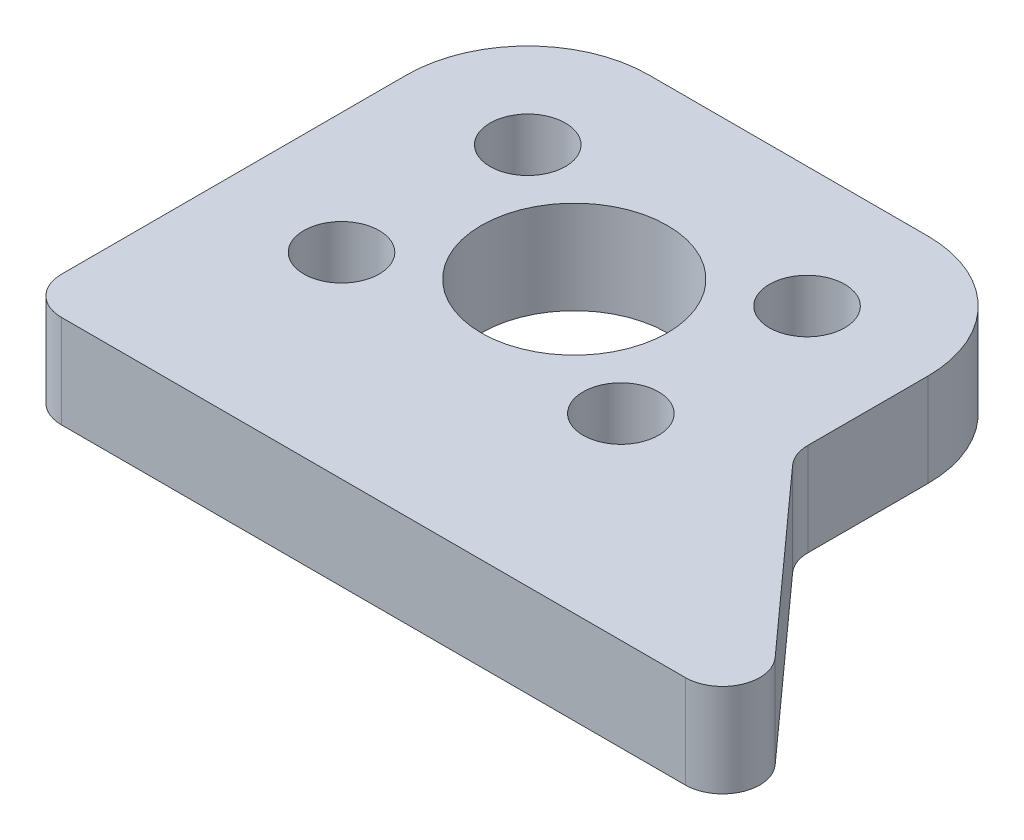
ISO-10303-21;
HEADER;
FILE_DESCRIPTION(('STEP AP214'),'2;1');
FILE_NAME('part.step','',(''),(''),'','','');
FILE_SCHEMA(('AUTOMOTIVE_DESIGN { 1 0 10303 214 1 1 1 1 }'));
ENDSEC;
DATA;
#1=APPLICATION_CONTEXT('core data for automotive mechanical design processes');
#2=APPLICATION_PROTOCOL_DEFINITION('international standard','automotive_design',2000,#1);
#3=PRODUCT_CONTEXT('',#1,'mechanical');
#4=PRODUCT('Part','Part','',(#3));
#5=PRODUCT_RELATED_PRODUCT_CATEGORY('part','',(#4));
#6=PRODUCT_DEFINITION_FORMATION('','',#4);
#7=PRODUCT_DEFINITION_CONTEXT('part definition',#1,'design');
#8=PRODUCT_DEFINITION('design','',#6,#7);
#9=PRODUCT_DEFINITION_SHAPE('','',#8);
#10=(LENGTH_UNIT() NAMED_UNIT(*) SI_UNIT(.MILLI.,.METRE.));
#11=(NAMED_UNIT(*) PLANE_ANGLE_UNIT() SI_UNIT($,.RADIAN.));
#12=(NAMED_UNIT(*) SI_UNIT($,.STERADIAN.) SOLID_ANGLE_UNIT());
#13=UNCERTAINTY_MEASURE_WITH_UNIT(LENGTH_MEASURE(1.E-05),#10,'distance_accuracy_value','');
#14=(GEOMETRIC_REPRESENTATION_CONTEXT(3) GLOBAL_UNCERTAINTY_ASSIGNED_CONTEXT((#13)) GLOBAL_UNIT_ASSIGNED_CONTEXT((#10,
#11,#12)) REPRESENTATION_CONTEXT('',''));
#15=CARTESIAN_POINT('',(0.,0.,0.));
#16=DIRECTION('',(0.,0.,1.));
#17=DIRECTION('',(1.,0.,0.));
#18=AXIS2_PLACEMENT_3D('',#15,#16,#17);
#19=CARTESIAN_POINT('',(-7.5,5.,5.));
#20=DIRECTION('',(0.,-1.,0.));
#21=DIRECTION('',(0.,0.,-1.));
#22=AXIS2_PLACEMENT_3D('',#19,#20,#21);
#23=CYLINDRICAL_SURFACE('',#22,2.025);
#24=CARTESIAN_POINT('',(-7.5,5.,5.));
#25=DIRECTION('',(0.,1.,0.));
#26=DIRECTION('',(0.,0.,1.));
#27=AXIS2_PLACEMENT_3D('',#24,#25,#26);
#28=CIRCLE('',#27,2.025);
#29=CARTESIAN_POINT('',(-7.5,5.,7.025));
#30=VERTEX_POINT('',#29);
#31=EDGE_CURVE('E264',#30,#30,#28,.T.);
#32=ORIENTED_EDGE('',*,*,#31,.T.);
#33=EDGE_LOOP('',(#32));
#34=FACE_BOUND('',#33,.T.);
#35=CARTESIAN_POINT('',(-7.5,0.,5.));
#36=DIRECTION('',(0.,1.,0.));
#37=DIRECTION('',(0.,0.,1.));
#38=AXIS2_PLACEMENT_3D('',#35,#36,#37);
#39=CIRCLE('',#38,2.025);
#40=CARTESIAN_POINT('',(-7.5,0.,7.025));
#41=VERTEX_POINT('',#40);
#42=EDGE_CURVE('E282',#41,#41,#39,.T.);
#43=ORIENTED_EDGE('',*,*,#42,.F.);
#44=EDGE_LOOP('',(#43));
#45=FACE_BOUND('',#44,.T.);
#46=ADVANCED_FACE('F91',(#34,#45),#23,.F.);
#47=CARTESIAN_POINT('',(7.5,5.,5.));
#48=DIRECTION('',(0.,-1.,0.));
#49=DIRECTION('',(0.,0.,-1.));
#50=AXIS2_PLACEMENT_3D('',#47,#48,#49);
#51=CYLINDRICAL_SURFACE('',#50,2.025);
#52=CARTESIAN_POINT('',(7.5,5.,5.));
#53=DIRECTION('',(0.,1.,0.));
#54=DIRECTION('',(0.,0.,1.));
#55=AXIS2_PLACEMENT_3D('',#52,#53,#54);
#56=CIRCLE('',#55,2.025);
#57=CARTESIAN_POINT('',(7.5,5.,7.025));
#58=VERTEX_POINT('',#57);
#59=EDGE_CURVE('E257',#58,#58,#56,.T.);
#60=ORIENTED_EDGE('',*,*,#59,.T.);
#61=EDGE_LOOP('',(#60));
#62=FACE_BOUND('',#61,.T.);
#63=CARTESIAN_POINT('',(7.5,0.,5.));
#64=DIRECTION('',(0.,1.,0.));
#65=DIRECTION('',(0.,0.,1.));
#66=AXIS2_PLACEMENT_3D('',#63,#64,#65);
#67=CIRCLE('',#66,2.025);
#68=CARTESIAN_POINT('',(7.5,0.,7.025));
#69=VERTEX_POINT('',#68);
#70=EDGE_CURVE('E279',#69,#69,#67,.T.);
#71=ORIENTED_EDGE('',*,*,#70,.F.);
#72=EDGE_LOOP('',(#71));
#73=FACE_BOUND('',#72,.T.);
#74=ADVANCED_FACE('F333',(#62,#73),#51,.F.);
#75=CARTESIAN_POINT('',(-14.,5.,0.));
#76=DIRECTION('',(1.,0.,0.));
#77=DIRECTION('',(0.,0.,-1.));
#78=AXIS2_PLACEMENT_3D('',#75,#76,#77);
#79=PLANE('',#78);
#80=DIRECTION('',(0.,0.,1.));
#81=VECTOR('',#80,1.);
#82=CARTESIAN_POINT('',(-14.,0.,0.));
#83=LINE('',#82,#81);
#84=CARTESIAN_POINT('',(-14.,0.,-5.));
#85=VERTEX_POINT('',#84);
#86=CARTESIAN_POINT('',(-14.,0.,13.5463315243403));
#87=VERTEX_POINT('',#86);
#88=EDGE_CURVE('E271',#85,#87,#83,.T.);
#89=ORIENTED_EDGE('',*,*,#88,.T.);
#90=DIRECTION('',(0.,-1.,0.));
#91=VECTOR('',#90,1.);
#92=CARTESIAN_POINT('',(-14.,5.,13.5463315243403));
#93=LINE('',#92,#91);
#94=CARTESIAN_POINT('',(-14.,5.,13.5463315243403));
#95=VERTEX_POINT('',#94);
#96=EDGE_CURVE('E106',#87,#95,#93,.F.);
#97=ORIENTED_EDGE('',*,*,#96,.T.);
#98=DIRECTION('',(0.,0.,1.));
#99=VECTOR('',#98,1.);
#100=CARTESIAN_POINT('',(-14.,5.,0.));
#101=LINE('',#100,#99);
#102=CARTESIAN_POINT('',(-14.,5.,-5.));
#103=VERTEX_POINT('',#102);
#104=EDGE_CURVE('E165',#103,#95,#101,.T.);
#105=ORIENTED_EDGE('',*,*,#104,.F.);
#106=DIRECTION('',(0.,-1.,0.));
#107=VECTOR('',#106,1.);
#108=CARTESIAN_POINT('',(-14.,5.,-5.));
#109=LINE('',#108,#107);
#110=EDGE_CURVE('E169',#103,#85,#109,.T.);
#111=ORIENTED_EDGE('',*,*,#110,.T.);
#112=EDGE_LOOP('',(#89,#97,#105,#111));
#113=FACE_BOUND('',#112,.T.);
#114=ADVANCED_FACE('F167',(#113),#79,.F.);
#115=CARTESIAN_POINT('',(0.,5.,15.5463315243403));
#116=DIRECTION('',(0.,0.,-1.));
#117=DIRECTION('',(-1.,0.,0.));
#118=AXIS2_PLACEMENT_3D('',#115,#116,#117);
#119=PLANE('',#118);
#120=DIRECTION('',(1.,0.,0.));
#121=VECTOR('',#120,1.);
#122=CARTESIAN_POINT('',(0.,5.,15.5463315243403));
#123=LINE('',#122,#121);
#124=CARTESIAN_POINT('',(-12.,5.,15.5463315243403));
#125=VERTEX_POINT('',#124);
#126=CARTESIAN_POINT('',(21.5079264521916,5.,15.5463315243403));
#127=VERTEX_POINT('',#126);
#128=EDGE_CURVE('E173',#125,#127,#123,.T.);
#129=ORIENTED_EDGE('',*,*,#128,.F.);
#130=DIRECTION('',(0.,-1.,0.));
#131=VECTOR('',#130,1.);
#132=CARTESIAN_POINT('',(-12.,5.,15.5463315243403));
#133=LINE('',#132,#131);
#134=CARTESIAN_POINT('',(-12.,0.,15.5463315243403));
#135=VERTEX_POINT('',#134);
#136=EDGE_CURVE('E218',#125,#135,#133,.T.);
#137=ORIENTED_EDGE('',*,*,#136,.T.);
#138=DIRECTION('',(1.,0.,0.));
#139=VECTOR('',#138,1.);
#140=CARTESIAN_POINT('',(0.,0.,15.5463315243403));
#141=LINE('',#140,#139);
#142=CARTESIAN_POINT('',(21.5079264521916,0.,15.5463315243403));
#143=VERTEX_POINT('',#142);
#144=EDGE_CURVE('E245',#135,#143,#141,.T.);
#145=ORIENTED_EDGE('',*,*,#144,.T.);
#146=DIRECTION('',(0.,-1.,0.));
#147=VECTOR('',#146,1.);
#148=CARTESIAN_POINT('',(21.5079264521916,5.,15.5463315243403));
#149=LINE('',#148,#147);
#150=EDGE_CURVE('E216',#143,#127,#149,.F.);
#151=ORIENTED_EDGE('',*,*,#150,.T.);
#152=EDGE_LOOP('',(#129,#137,#145,#151));
#153=FACE_BOUND('',#152,.T.);
#154=ADVANCED_FACE('F297',(#153),#119,.F.);
#155=CARTESIAN_POINT('',(6.62828647567442,5.,-5.96813594946186));
#156=DIRECTION('',(0.743144825477398,0.,-0.669130606358854));
#157=DIRECTION('',(-0.669130606358854,0.,-0.743144825477398));
#158=AXIS2_PLACEMENT_3D('',#155,#156,#157);
#159=PLANE('',#158);
#160=DIRECTION('',(0.669130606358854,0.,0.743144825477398));
#161=VECTOR('',#160,1.);
#162=CARTESIAN_POINT('',(6.62828647567442,0.,-5.96813594946186));
#163=LINE('',#162,#161);
#164=CARTESIAN_POINT('',(14.5137103490452,0.,2.78951448903672));
#165=VERTEX_POINT('',#164);
#166=CARTESIAN_POINT('',(22.9942161031464,0.,12.2080703116226));
#167=VERTEX_POINT('',#166);
#168=EDGE_CURVE('E233',#165,#167,#163,.T.);
#169=ORIENTED_EDGE('',*,*,#168,.F.);
#170=DIRECTION('',(0.,-1.,0.));
#171=VECTOR('',#170,1.);
#172=CARTESIAN_POINT('',(14.5137103490452,5.,2.78951448903672));
#173=LINE('',#172,#171);
#174=CARTESIAN_POINT('',(14.5137103490452,5.,2.78951448903672));
#175=VERTEX_POINT('',#174);
#176=EDGE_CURVE('E214',#165,#175,#173,.F.);
#177=ORIENTED_EDGE('',*,*,#176,.T.);
#178=DIRECTION('',(0.669130606358854,0.,0.743144825477398));
#179=VECTOR('',#178,1.);
#180=CARTESIAN_POINT('',(6.62828647567442,5.,-5.96813594946186));
#181=LINE('',#180,#179);
#182=CARTESIAN_POINT('',(22.9942161031464,5.,12.2080703116226));
#183=VERTEX_POINT('',#182);
#184=EDGE_CURVE('E252',#175,#183,#181,.T.);
#185=ORIENTED_EDGE('',*,*,#184,.T.);
#186=DIRECTION('',(0.,-1.,0.));
#187=VECTOR('',#186,1.);
#188=CARTESIAN_POINT('',(22.9942161031464,0.,12.2080703116226));
#189=LINE('',#188,#187);
#190=EDGE_CURVE('E193',#183,#167,#189,.T.);
#191=ORIENTED_EDGE('',*,*,#190,.T.);
#192=EDGE_LOOP('',(#169,#177,#185,#191));
#193=FACE_BOUND('',#192,.T.);
#194=ADVANCED_FACE('F241',(#193),#159,.T.);
#195=CARTESIAN_POINT('',(14.,5.,0.));
#196=DIRECTION('',(1.,0.,0.));
#197=DIRECTION('',(0.,0.,-1.));
#198=AXIS2_PLACEMENT_3D('',#195,#196,#197);
#199=PLANE('',#198);
#200=DIRECTION('',(0.,0.,1.));
#201=VECTOR('',#200,1.);
#202=CARTESIAN_POINT('',(14.,5.,0.));
#203=LINE('',#202,#201);
#204=CARTESIAN_POINT('',(14.,5.,-5.));
#205=VERTEX_POINT('',#204);
#206=CARTESIAN_POINT('',(14.,5.,1.45125327631901));
#207=VERTEX_POINT('',#206);
#208=EDGE_CURVE('E251',#205,#207,#203,.T.);
#209=ORIENTED_EDGE('',*,*,#208,.T.);
#210=DIRECTION('',(0.,-1.,0.));
#211=VECTOR('',#210,1.);
#212=CARTESIAN_POINT('',(14.,0.,1.45125327631901));
#213=LINE('',#212,#211);
#214=CARTESIAN_POINT('',(14.,0.,1.45125327631901));
#215=VERTEX_POINT('',#214);
#216=EDGE_CURVE('E189',#207,#215,#213,.T.);
#217=ORIENTED_EDGE('',*,*,#216,.T.);
#218=DIRECTION('',(0.,0.,1.));
#219=VECTOR('',#218,1.);
#220=CARTESIAN_POINT('',(14.,0.,0.));
#221=LINE('',#220,#219);
#222=CARTESIAN_POINT('',(14.,0.,-5.));
#223=VERTEX_POINT('',#222);
#224=EDGE_CURVE('E236',#223,#215,#221,.T.);
#225=ORIENTED_EDGE('',*,*,#224,.F.);
#226=DIRECTION('',(0.,-1.,0.));
#227=VECTOR('',#226,1.);
#228=CARTESIAN_POINT('',(14.,5.,-5.));
#229=LINE('',#228,#227);
#230=EDGE_CURVE('E190',#205,#223,#229,.T.);
#231=ORIENTED_EDGE('',*,*,#230,.F.);
#232=EDGE_LOOP('',(#209,#217,#225,#231));
#233=FACE_BOUND('',#232,.T.);
#234=ADVANCED_FACE('F254',(#233),#199,.T.);
#235=CARTESIAN_POINT('',(0.,5.,-11.5));
#236=DIRECTION('',(0.,0.,-1.));
#237=DIRECTION('',(-1.,0.,0.));
#238=AXIS2_PLACEMENT_3D('',#235,#236,#237);
#239=PLANE('',#238);
#240=DIRECTION('',(1.,0.,0.));
#241=VECTOR('',#240,1.);
#242=CARTESIAN_POINT('',(0.,0.,-11.5));
#243=LINE('',#242,#241);
#244=CARTESIAN_POINT('',(-7.5,0.,-11.5));
#245=VERTEX_POINT('',#244);
#246=CARTESIAN_POINT('',(7.5,0.,-11.5));
#247=VERTEX_POINT('',#246);
#248=EDGE_CURVE('E276',#245,#247,#243,.T.);
#249=ORIENTED_EDGE('',*,*,#248,.F.);
#250=DIRECTION('',(0.,-1.,0.));
#251=VECTOR('',#250,1.);
#252=CARTESIAN_POINT('',(-7.5,5.,-11.5));
#253=LINE('',#252,#251);
#254=CARTESIAN_POINT('',(-7.5,5.,-11.5));
#255=VERTEX_POINT('',#254);
#256=EDGE_CURVE('E267',#255,#245,#253,.T.);
#257=ORIENTED_EDGE('',*,*,#256,.F.);
#258=DIRECTION('',(1.,0.,0.));
#259=VECTOR('',#258,1.);
#260=CARTESIAN_POINT('',(0.,5.,-11.5));
#261=LINE('',#260,#259);
#262=CARTESIAN_POINT('',(7.5,5.,-11.5));
#263=VERTEX_POINT('',#262);
#264=EDGE_CURVE('E182',#255,#263,#261,.T.);
#265=ORIENTED_EDGE('',*,*,#264,.T.);
#266=DIRECTION('',(0.,-1.,0.));
#267=VECTOR('',#266,1.);
#268=CARTESIAN_POINT('',(7.5,5.,-11.5));
#269=LINE('',#268,#267);
#270=EDGE_CURVE('E195',#263,#247,#269,.T.);
#271=ORIENTED_EDGE('',*,*,#270,.T.);
#272=EDGE_LOOP('',(#249,#257,#265,#271));
#273=FACE_BOUND('',#272,.T.);
#274=ADVANCED_FACE('F287',(#273),#239,.T.);
#275=CARTESIAN_POINT('',(-7.5,5.,-5.));
#276=DIRECTION('',(0.,-1.,0.));
#277=DIRECTION('',(0.,0.,-1.));
#278=AXIS2_PLACEMENT_3D('',#275,#276,#277);
#279=CYLINDRICAL_SURFACE('',#278,6.5);
#280=CARTESIAN_POINT('',(-7.5,0.,-5.));
#281=DIRECTION('',(0.,1.,0.));
#282=DIRECTION('',(0.,0.,1.));
#283=AXIS2_PLACEMENT_3D('',#280,#281,#282);
#284=CIRCLE('',#283,6.5);
#285=EDGE_CURVE('E188',#245,#85,#284,.T.);
#286=ORIENTED_EDGE('',*,*,#285,.T.);
#287=ORIENTED_EDGE('',*,*,#110,.F.);
#288=CARTESIAN_POINT('',(-7.5,5.,-5.));
#289=DIRECTION('',(0.,1.,0.));
#290=DIRECTION('',(0.,0.,1.));
#291=AXIS2_PLACEMENT_3D('',#288,#289,#290);
#292=CIRCLE('',#291,6.5);
#293=EDGE_CURVE('E174',#255,#103,#292,.T.);
#294=ORIENTED_EDGE('',*,*,#293,.F.);
#295=ORIENTED_EDGE('',*,*,#256,.T.);
#296=EDGE_LOOP('',(#286,#287,#294,#295));
#297=FACE_BOUND('',#296,.T.);
#298=ADVANCED_FACE('F186',(#297),#279,.T.);
#299=CARTESIAN_POINT('',(-7.5,5.,-5.));
#300=DIRECTION('',(0.,-1.,0.));
#301=DIRECTION('',(0.,0.,-1.));
#302=AXIS2_PLACEMENT_3D('',#299,#300,#301);
#303=CYLINDRICAL_SURFACE('',#302,2.025);
#304=CARTESIAN_POINT('',(-7.5,5.,-5.));
#305=DIRECTION('',(0.,1.,0.));
#306=DIRECTION('',(0.,0.,1.));
#307=AXIS2_PLACEMENT_3D('',#304,#305,#306);
#308=CIRCLE('',#307,2.025);
#309=CARTESIAN_POINT('',(-7.5,5.,-2.975));
#310=VERTEX_POINT('',#309);
#311=EDGE_CURVE('E184',#310,#310,#308,.T.);
#312=ORIENTED_EDGE('',*,*,#311,.T.);
#313=EDGE_LOOP('',(#312));
#314=FACE_BOUND('',#313,.T.);
#315=CARTESIAN_POINT('',(-7.5,0.,-5.));
#316=DIRECTION('',(0.,1.,0.));
#317=DIRECTION('',(0.,0.,1.));
#318=AXIS2_PLACEMENT_3D('',#315,#316,#317);
#319=CIRCLE('',#318,2.025);
#320=CARTESIAN_POINT('',(-7.5,0.,-2.975));
#321=VERTEX_POINT('',#320);
#322=EDGE_CURVE('E209',#321,#321,#319,.T.);
#323=ORIENTED_EDGE('',*,*,#322,.F.);
#324=EDGE_LOOP('',(#323));
#325=FACE_BOUND('',#324,.T.);
#326=ADVANCED_FACE('F322',(#314,#325),#303,.F.);
#327=CARTESIAN_POINT('',(0.,0.,0.));
#328=DIRECTION('',(0.,1.,0.));
#329=DIRECTION('',(0.,0.,1.));
#330=AXIS2_PLACEMENT_3D('',#327,#328,#329);
#331=PLANE('',#330);
#332=CARTESIAN_POINT('',(0.,0.,0.));
#333=DIRECTION('',(0.,1.,0.));
#334=DIRECTION('',(0.,0.,1.));
#335=AXIS2_PLACEMENT_3D('',#332,#333,#334);
#336=CIRCLE('',#335,5.);
#337=CARTESIAN_POINT('',(0.,0.,5.));
#338=VERTEX_POINT('',#337);
#339=EDGE_CURVE('E206',#338,#338,#336,.T.);
#340=ORIENTED_EDGE('',*,*,#339,.T.);
#341=EDGE_LOOP('',(#340));
#342=FACE_BOUND('',#341,.T.);
#343=ORIENTED_EDGE('',*,*,#322,.T.);
#344=EDGE_LOOP('',(#343));
#345=FACE_BOUND('',#344,.T.);
#346=ORIENTED_EDGE('',*,*,#144,.F.);
#347=CARTESIAN_POINT('',(-12.,0.,13.5463315243403));
#348=DIRECTION('',(0.,1.,0.));
#349=DIRECTION('',(0.,0.,1.));
#350=AXIS2_PLACEMENT_3D('',#347,#348,#349);
#351=CIRCLE('',#350,2.);
#352=EDGE_CURVE('E114',#135,#87,#351,.F.);
#353=ORIENTED_EDGE('',*,*,#352,.T.);
#354=ORIENTED_EDGE('',*,*,#88,.F.);
#355=ORIENTED_EDGE('',*,*,#285,.F.);
#356=ORIENTED_EDGE('',*,*,#248,.T.);
#357=CARTESIAN_POINT('',(7.5,0.,-5.));
#358=DIRECTION('',(0.,1.,0.));
#359=DIRECTION('',(0.,0.,1.));
#360=AXIS2_PLACEMENT_3D('',#357,#358,#359);
#361=CIRCLE('',#360,6.5);
#362=EDGE_CURVE('E202',#223,#247,#361,.T.);
#363=ORIENTED_EDGE('',*,*,#362,.F.);
#364=ORIENTED_EDGE('',*,*,#224,.T.);
#365=CARTESIAN_POINT('',(16.,0.,1.45125327631901));
#366=DIRECTION('',(0.,1.,0.));
#367=DIRECTION('',(0.,0.,1.));
#368=AXIS2_PLACEMENT_3D('',#365,#366,#367);
#369=CIRCLE('',#368,2.);
#370=EDGE_CURVE('E99',#215,#165,#369,.T.);
#371=ORIENTED_EDGE('',*,*,#370,.T.);
#372=ORIENTED_EDGE('',*,*,#168,.T.);
#373=CARTESIAN_POINT('',(21.5079264521916,0.,13.5463315243403));
#374=DIRECTION('',(0.,1.,0.));
#375=DIRECTION('',(0.,0.,1.));
#376=AXIS2_PLACEMENT_3D('',#373,#374,#375);
#377=CIRCLE('',#376,2.);
#378=EDGE_CURVE('E221',#167,#143,#377,.F.);
#379=ORIENTED_EDGE('',*,*,#378,.T.);
#380=EDGE_LOOP('',(#346,#353,#354,#355,#356,#363,#364,#371,#372,#379));
#381=FACE_BOUND('',#380,.T.);
#382=ORIENTED_EDGE('',*,*,#70,.T.);
#383=EDGE_LOOP('',(#382));
#384=FACE_BOUND('',#383,.T.);
#385=ORIENTED_EDGE('',*,*,#42,.T.);
#386=EDGE_LOOP('',(#385));
#387=FACE_BOUND('',#386,.T.);
#388=CARTESIAN_POINT('',(7.5,0.,-5.));
#389=DIRECTION('',(0.,1.,0.));
#390=DIRECTION('',(0.,0.,1.));
#391=AXIS2_PLACEMENT_3D('',#388,#389,#390);
#392=CIRCLE('',#391,2.025);
#393=CARTESIAN_POINT('',(7.5,0.,-2.975));
#394=VERTEX_POINT('',#393);
#395=EDGE_CURVE('E203',#394,#394,#392,.T.);
#396=ORIENTED_EDGE('',*,*,#395,.T.);
#397=EDGE_LOOP('',(#396));
#398=FACE_BOUND('',#397,.T.);
#399=ADVANCED_FACE('F231',(#342,#345,#381,#384,#387,#398),#331,.F.);
#400=CARTESIAN_POINT('',(0.,5.,0.));
#401=DIRECTION('',(0.,1.,0.));
#402=DIRECTION('',(0.,0.,1.));
#403=AXIS2_PLACEMENT_3D('',#400,#401,#402);
#404=PLANE('',#403);
#405=CARTESIAN_POINT('',(0.,5.,0.));
#406=DIRECTION('',(0.,1.,0.));
#407=DIRECTION('',(0.,0.,1.));
#408=AXIS2_PLACEMENT_3D('',#405,#406,#407);
#409=CIRCLE('',#408,5.);
#410=CARTESIAN_POINT('',(0.,5.,5.));
#411=VERTEX_POINT('',#410);
#412=EDGE_CURVE('E302',#411,#411,#409,.T.);
#413=ORIENTED_EDGE('',*,*,#412,.F.);
#414=EDGE_LOOP('',(#413));
#415=FACE_BOUND('',#414,.T.);
#416=ORIENTED_EDGE('',*,*,#311,.F.);
#417=EDGE_LOOP('',(#416));
#418=FACE_BOUND('',#417,.T.);
#419=ORIENTED_EDGE('',*,*,#104,.T.);
#420=CARTESIAN_POINT('',(-12.,5.,13.5463315243403));
#421=DIRECTION('',(0.,1.,0.));
#422=DIRECTION('',(0.,0.,1.));
#423=AXIS2_PLACEMENT_3D('',#420,#421,#422);
#424=CIRCLE('',#423,2.);
#425=EDGE_CURVE('E227',#95,#125,#424,.T.);
#426=ORIENTED_EDGE('',*,*,#425,.T.);
#427=ORIENTED_EDGE('',*,*,#128,.T.);
#428=CARTESIAN_POINT('',(21.5079264521916,5.,13.5463315243403));
#429=DIRECTION('',(0.,1.,0.));
#430=DIRECTION('',(0.,0.,1.));
#431=AXIS2_PLACEMENT_3D('',#428,#429,#430);
#432=CIRCLE('',#431,2.);
#433=EDGE_CURVE('E225',#127,#183,#432,.T.);
#434=ORIENTED_EDGE('',*,*,#433,.T.);
#435=ORIENTED_EDGE('',*,*,#184,.F.);
#436=CARTESIAN_POINT('',(16.,5.,1.45125327631901));
#437=DIRECTION('',(0.,1.,0.));
#438=DIRECTION('',(0.,0.,1.));
#439=AXIS2_PLACEMENT_3D('',#436,#437,#438);
#440=CIRCLE('',#439,2.);
#441=EDGE_CURVE('E12',#175,#207,#440,.F.);
#442=ORIENTED_EDGE('',*,*,#441,.T.);
#443=ORIENTED_EDGE('',*,*,#208,.F.);
#444=CARTESIAN_POINT('',(7.5,5.,-5.));
#445=DIRECTION('',(0.,1.,0.));
#446=DIRECTION('',(0.,0.,1.));
#447=AXIS2_PLACEMENT_3D('',#444,#445,#446);
#448=CIRCLE('',#447,6.5);
#449=EDGE_CURVE('E207',#205,#263,#448,.T.);
#450=ORIENTED_EDGE('',*,*,#449,.T.);
#451=ORIENTED_EDGE('',*,*,#264,.F.);
#452=ORIENTED_EDGE('',*,*,#293,.T.);
#453=EDGE_LOOP('',(#419,#426,#427,#434,#435,#442,#443,#450,#451,#452));
#454=FACE_BOUND('',#453,.T.);
#455=ORIENTED_EDGE('',*,*,#59,.F.);
#456=EDGE_LOOP('',(#455));
#457=FACE_BOUND('',#456,.T.);
#458=ORIENTED_EDGE('',*,*,#31,.F.);
#459=EDGE_LOOP('',(#458));
#460=FACE_BOUND('',#459,.T.);
#461=CARTESIAN_POINT('',(7.5,5.,-5.));
#462=DIRECTION('',(0.,1.,0.));
#463=DIRECTION('',(0.,0.,1.));
#464=AXIS2_PLACEMENT_3D('',#461,#462,#463);
#465=CIRCLE('',#464,2.025);
#466=CARTESIAN_POINT('',(7.5,5.,-2.975));
#467=VERTEX_POINT('',#466);
#468=EDGE_CURVE('E199',#467,#467,#465,.T.);
#469=ORIENTED_EDGE('',*,*,#468,.F.);
#470=EDGE_LOOP('',(#469));
#471=FACE_BOUND('',#470,.T.);
#472=ADVANCED_FACE('F178',(#415,#418,#454,#457,#460,#471),#404,.T.);
#473=CARTESIAN_POINT('',(7.5,5.,-5.));
#474=DIRECTION('',(0.,-1.,0.));
#475=DIRECTION('',(0.,0.,-1.));
#476=AXIS2_PLACEMENT_3D('',#473,#474,#475);
#477=CYLINDRICAL_SURFACE('',#476,2.025);
#478=ORIENTED_EDGE('',*,*,#468,.T.);
#479=EDGE_LOOP('',(#478));
#480=FACE_BOUND('',#479,.T.);
#481=ORIENTED_EDGE('',*,*,#395,.F.);
#482=EDGE_LOOP('',(#481));
#483=FACE_BOUND('',#482,.T.);
#484=ADVANCED_FACE('F318',(#480,#483),#477,.F.);
#485=CARTESIAN_POINT('',(7.5,5.,-5.));
#486=DIRECTION('',(0.,-1.,0.));
#487=DIRECTION('',(0.,0.,-1.));
#488=AXIS2_PLACEMENT_3D('',#485,#486,#487);
#489=CYLINDRICAL_SURFACE('',#488,6.5);
#490=ORIENTED_EDGE('',*,*,#230,.T.);
#491=ORIENTED_EDGE('',*,*,#362,.T.);
#492=ORIENTED_EDGE('',*,*,#270,.F.);
#493=ORIENTED_EDGE('',*,*,#449,.F.);
#494=EDGE_LOOP('',(#490,#491,#492,#493));
#495=FACE_BOUND('',#494,.T.);
#496=ADVANCED_FACE('F289',(#495),#489,.T.);
#497=CARTESIAN_POINT('',(16.,5.,1.45125327631901));
#498=DIRECTION('',(0.,1.,0.));
#499=DIRECTION('',(0.,0.,1.));
#500=AXIS2_PLACEMENT_3D('',#497,#498,#499);
#501=CYLINDRICAL_SURFACE('',#500,2.);
#502=ORIENTED_EDGE('',*,*,#441,.F.);
#503=ORIENTED_EDGE('',*,*,#176,.F.);
#504=ORIENTED_EDGE('',*,*,#370,.F.);
#505=ORIENTED_EDGE('',*,*,#216,.F.);
#506=EDGE_LOOP('',(#502,#503,#504,#505));
#507=FACE_BOUND('',#506,.T.);
#508=ADVANCED_FACE('F248',(#507),#501,.F.);
#509=CARTESIAN_POINT('',(-12.,5.,13.5463315243403));
#510=DIRECTION('',(0.,-1.,0.));
#511=DIRECTION('',(0.,0.,-1.));
#512=AXIS2_PLACEMENT_3D('',#509,#510,#511);
#513=CYLINDRICAL_SURFACE('',#512,2.);
#514=ORIENTED_EDGE('',*,*,#425,.F.);
#515=ORIENTED_EDGE('',*,*,#96,.F.);
#516=ORIENTED_EDGE('',*,*,#352,.F.);
#517=ORIENTED_EDGE('',*,*,#136,.F.);
#518=EDGE_LOOP('',(#514,#515,#516,#517));
#519=FACE_BOUND('',#518,.T.);
#520=ADVANCED_FACE('F291',(#519),#513,.T.);
#521=CARTESIAN_POINT('',(21.5079264521916,5.,13.5463315243403));
#522=DIRECTION('',(0.,1.,0.));
#523=DIRECTION('',(0.,0.,1.));
#524=AXIS2_PLACEMENT_3D('',#521,#522,#523);
#525=CYLINDRICAL_SURFACE('',#524,2.);
#526=ORIENTED_EDGE('',*,*,#433,.F.);
#527=ORIENTED_EDGE('',*,*,#150,.F.);
#528=ORIENTED_EDGE('',*,*,#378,.F.);
#529=ORIENTED_EDGE('',*,*,#190,.F.);
#530=EDGE_LOOP('',(#526,#527,#528,#529));
#531=FACE_BOUND('',#530,.T.);
#532=ADVANCED_FACE('F93',(#531),#525,.T.);
#533=CARTESIAN_POINT('',(0.,0.,0.));
#534=DIRECTION('',(0.,1.,0.));
#535=DIRECTION('',(0.,0.,1.));
#536=AXIS2_PLACEMENT_3D('',#533,#534,#535);
#537=CYLINDRICAL_SURFACE('',#536,5.);
#538=ORIENTED_EDGE('',*,*,#339,.F.);
#539=EDGE_LOOP('',(#538));
#540=FACE_BOUND('',#539,.T.);
#541=ORIENTED_EDGE('',*,*,#412,.T.);
#542=EDGE_LOOP('',(#541));
#543=FACE_BOUND('',#542,.T.);
#544=ADVANCED_FACE('F310',(#540,#543),#537,.F.);
#545=CLOSED_SHELL('',(#46,#74,#114,#154,#194,#234,#274,#298,#326,#399,#472,#484,#496,#508,#520,
#532,#544));
#546=MANIFOLD_SOLID_BREP('B2',#545);
#547=ADVANCED_BREP_SHAPE_REPRESENTATION('',(#18,#546),#14);
#548=SHAPE_DEFINITION_REPRESENTATION(#9,#547);
ENDSEC;
END-ISO-10303-21;
